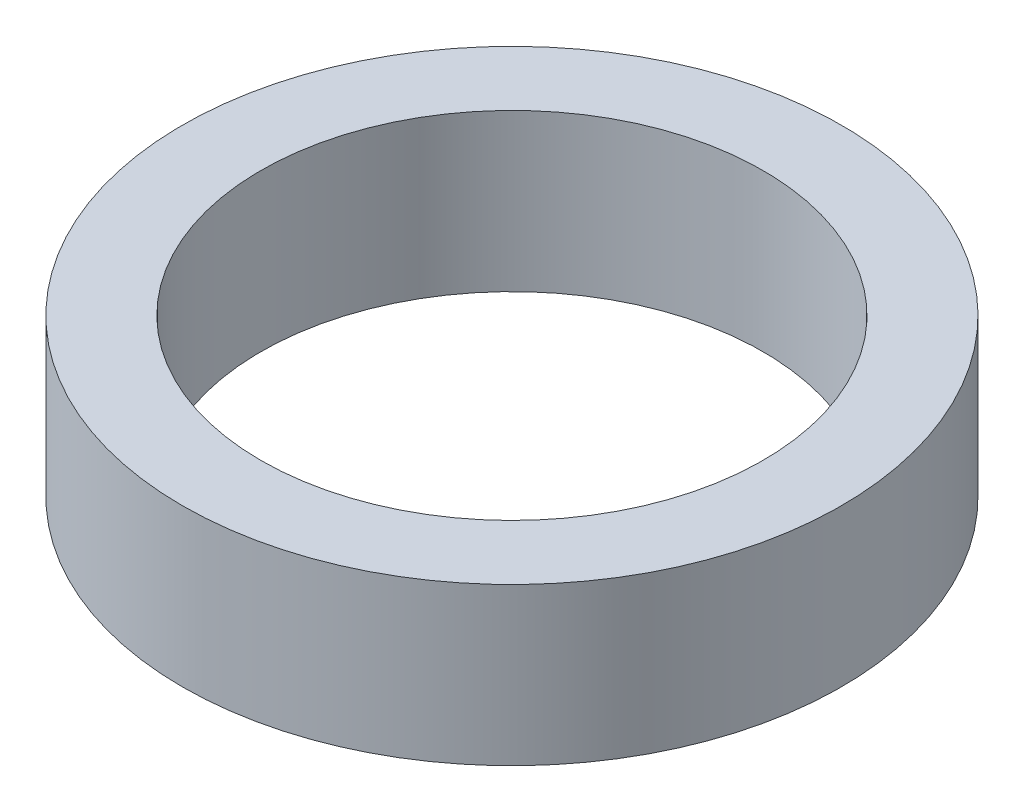
ISO-10303-21;
HEADER;
FILE_DESCRIPTION(('STEP AP214'),'2;1');
FILE_NAME('part.step','',(''),(''),'','','');
FILE_SCHEMA(('AUTOMOTIVE_DESIGN { 1 0 10303 214 1 1 1 1 }'));
ENDSEC;
DATA;
#1=APPLICATION_CONTEXT('core data for automotive mechanical design processes');
#2=APPLICATION_PROTOCOL_DEFINITION('international standard','automotive_design',2000,#1);
#3=PRODUCT_CONTEXT('',#1,'mechanical');
#4=PRODUCT('Part','Part','',(#3));
#5=PRODUCT_RELATED_PRODUCT_CATEGORY('part','',(#4));
#6=PRODUCT_DEFINITION_FORMATION('','',#4);
#7=PRODUCT_DEFINITION_CONTEXT('part definition',#1,'design');
#8=PRODUCT_DEFINITION('design','',#6,#7);
#9=PRODUCT_DEFINITION_SHAPE('','',#8);
#10=(LENGTH_UNIT() NAMED_UNIT(*) SI_UNIT(.MILLI.,.METRE.));
#11=(NAMED_UNIT(*) PLANE_ANGLE_UNIT() SI_UNIT($,.RADIAN.));
#12=(NAMED_UNIT(*) SI_UNIT($,.STERADIAN.) SOLID_ANGLE_UNIT());
#13=UNCERTAINTY_MEASURE_WITH_UNIT(LENGTH_MEASURE(1.E-05),#10,'distance_accuracy_value','');
#14=(GEOMETRIC_REPRESENTATION_CONTEXT(3) GLOBAL_UNCERTAINTY_ASSIGNED_CONTEXT((#13)) GLOBAL_UNIT_ASSIGNED_CONTEXT((#10,
#11,#12)) REPRESENTATION_CONTEXT('',''));
#15=CARTESIAN_POINT('',(0.,0.,0.));
#16=DIRECTION('',(0.,0.,1.));
#17=DIRECTION('',(1.,0.,0.));
#18=AXIS2_PLACEMENT_3D('',#15,#16,#17);
#19=CARTESIAN_POINT('',(0.,1.,0.));
#20=DIRECTION('',(0.,1.,0.));
#21=DIRECTION('',(0.,0.,1.));
#22=AXIS2_PLACEMENT_3D('',#19,#20,#21);
#23=PLANE('',#22);
#24=CARTESIAN_POINT('',(0.,1.,0.));
#25=DIRECTION('',(0.,1.,0.));
#26=DIRECTION('',(0.,0.,1.));
#27=AXIS2_PLACEMENT_3D('',#24,#25,#26);
#28=CIRCLE('',#27,2.1);
#29=CARTESIAN_POINT('',(0.,1.,2.1));
#30=VERTEX_POINT('',#29);
#31=EDGE_CURVE('E10',#30,#30,#28,.T.);
#32=ORIENTED_EDGE('',*,*,#31,.T.);
#33=EDGE_LOOP('',(#32));
#34=FACE_BOUND('',#33,.T.);
#35=CARTESIAN_POINT('',(0.,1.,0.));
#36=DIRECTION('',(0.,1.,0.));
#37=DIRECTION('',(0.,0.,1.));
#38=AXIS2_PLACEMENT_3D('',#35,#36,#37);
#39=CIRCLE('',#38,1.6);
#40=CARTESIAN_POINT('',(0.,1.,1.6));
#41=VERTEX_POINT('',#40);
#42=EDGE_CURVE('E53',#41,#41,#39,.T.);
#43=ORIENTED_EDGE('',*,*,#42,.F.);
#44=EDGE_LOOP('',(#43));
#45=FACE_BOUND('',#44,.T.);
#46=ADVANCED_FACE('F38',(#34,#45),#23,.T.);
#47=CARTESIAN_POINT('',(0.,0.,0.));
#48=DIRECTION('',(0.,1.,0.));
#49=DIRECTION('',(0.,0.,1.));
#50=AXIS2_PLACEMENT_3D('',#47,#48,#49);
#51=PLANE('',#50);
#52=CARTESIAN_POINT('',(0.,0.,0.));
#53=DIRECTION('',(0.,1.,0.));
#54=DIRECTION('',(0.,0.,1.));
#55=AXIS2_PLACEMENT_3D('',#52,#53,#54);
#56=CIRCLE('',#55,2.1);
#57=CARTESIAN_POINT('',(0.,0.,2.1));
#58=VERTEX_POINT('',#57);
#59=EDGE_CURVE('E42',#58,#58,#56,.T.);
#60=ORIENTED_EDGE('',*,*,#59,.F.);
#61=EDGE_LOOP('',(#60));
#62=FACE_BOUND('',#61,.T.);
#63=CARTESIAN_POINT('',(0.,0.,0.));
#64=DIRECTION('',(0.,1.,0.));
#65=DIRECTION('',(0.,0.,1.));
#66=AXIS2_PLACEMENT_3D('',#63,#64,#65);
#67=CIRCLE('',#66,1.6);
#68=CARTESIAN_POINT('',(0.,0.,1.6));
#69=VERTEX_POINT('',#68);
#70=EDGE_CURVE('E55',#69,#69,#67,.T.);
#71=ORIENTED_EDGE('',*,*,#70,.T.);
#72=EDGE_LOOP('',(#71));
#73=FACE_BOUND('',#72,.T.);
#74=ADVANCED_FACE('F65',(#62,#73),#51,.F.);
#75=CARTESIAN_POINT('',(0.,1.,0.));
#76=DIRECTION('',(0.,-1.,0.));
#77=DIRECTION('',(0.,0.,-1.));
#78=AXIS2_PLACEMENT_3D('',#75,#76,#77);
#79=CYLINDRICAL_SURFACE('',#78,2.1);
#80=ORIENTED_EDGE('',*,*,#31,.F.);
#81=EDGE_LOOP('',(#80));
#82=FACE_BOUND('',#81,.T.);
#83=ORIENTED_EDGE('',*,*,#59,.T.);
#84=EDGE_LOOP('',(#83));
#85=FACE_BOUND('',#84,.T.);
#86=ADVANCED_FACE('F40',(#82,#85),#79,.T.);
#87=CARTESIAN_POINT('',(0.,1.,0.));
#88=DIRECTION('',(0.,-1.,0.));
#89=DIRECTION('',(0.,0.,-1.));
#90=AXIS2_PLACEMENT_3D('',#87,#88,#89);
#91=CYLINDRICAL_SURFACE('',#90,1.6);
#92=ORIENTED_EDGE('',*,*,#42,.T.);
#93=EDGE_LOOP('',(#92));
#94=FACE_BOUND('',#93,.T.);
#95=ORIENTED_EDGE('',*,*,#70,.F.);
#96=EDGE_LOOP('',(#95));
#97=FACE_BOUND('',#96,.T.);
#98=ADVANCED_FACE('F61',(#94,#97),#91,.F.);
#99=CLOSED_SHELL('',(#46,#74,#86,#98));
#100=MANIFOLD_SOLID_BREP('B2',#99);
#101=ADVANCED_BREP_SHAPE_REPRESENTATION('',(#18,#100),#14);
#102=SHAPE_DEFINITION_REPRESENTATION(#9,#101);
ENDSEC;
END-ISO-10303-21;
